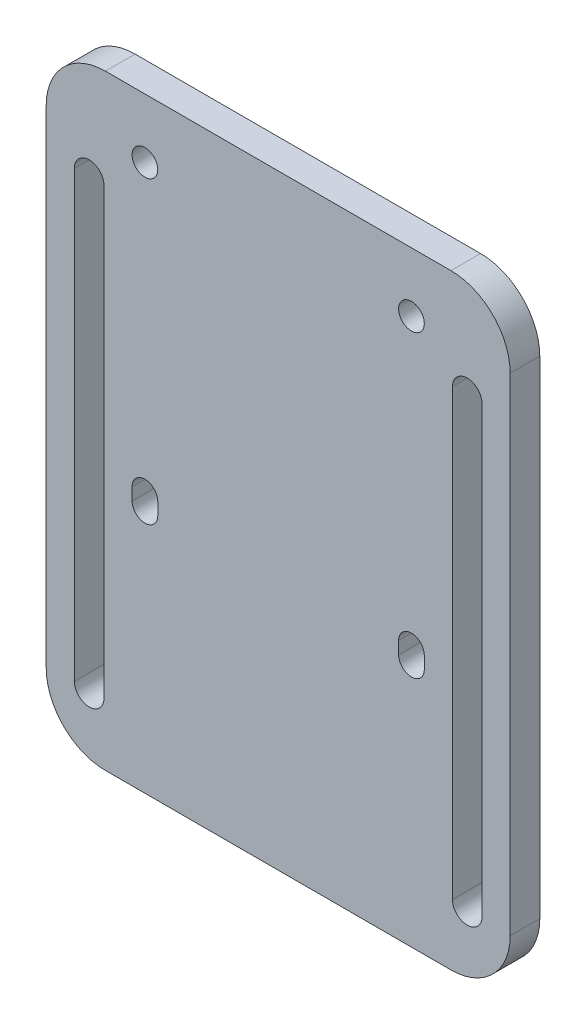
ISO-10303-21;
HEADER;
FILE_DESCRIPTION(('STEP AP214'),'2;1');
FILE_NAME('part.step','',(''),(''),'','','');
FILE_SCHEMA(('AUTOMOTIVE_DESIGN { 1 0 10303 214 1 1 1 1 }'));
ENDSEC;
DATA;
#1=APPLICATION_CONTEXT('core data for automotive mechanical design processes');
#2=APPLICATION_PROTOCOL_DEFINITION('international standard','automotive_design',2000,#1);
#3=PRODUCT_CONTEXT('',#1,'mechanical');
#4=PRODUCT('Part','Part','',(#3));
#5=PRODUCT_RELATED_PRODUCT_CATEGORY('part','',(#4));
#6=PRODUCT_DEFINITION_FORMATION('','',#4);
#7=PRODUCT_DEFINITION_CONTEXT('part definition',#1,'design');
#8=PRODUCT_DEFINITION('design','',#6,#7);
#9=PRODUCT_DEFINITION_SHAPE('','',#8);
#10=(LENGTH_UNIT() NAMED_UNIT(*) SI_UNIT(.MILLI.,.METRE.));
#11=(NAMED_UNIT(*) PLANE_ANGLE_UNIT() SI_UNIT($,.RADIAN.));
#12=(NAMED_UNIT(*) SI_UNIT($,.STERADIAN.) SOLID_ANGLE_UNIT());
#13=UNCERTAINTY_MEASURE_WITH_UNIT(LENGTH_MEASURE(1.E-05),#10,'distance_accuracy_value','');
#14=(GEOMETRIC_REPRESENTATION_CONTEXT(3) GLOBAL_UNCERTAINTY_ASSIGNED_CONTEXT((#13)) GLOBAL_UNIT_ASSIGNED_CONTEXT((#10,
#11,#12)) REPRESENTATION_CONTEXT('',''));
#15=CARTESIAN_POINT('',(0.,0.,0.));
#16=DIRECTION('',(0.,0.,1.));
#17=DIRECTION('',(1.,0.,0.));
#18=AXIS2_PLACEMENT_3D('',#15,#16,#17);
#19=CARTESIAN_POINT('',(-35.3,0.,6.));
#20=DIRECTION('',(1.,0.,0.));
#21=DIRECTION('',(0.,0.,-1.));
#22=AXIS2_PLACEMENT_3D('',#19,#20,#21);
#23=PLANE('',#22);
#24=DIRECTION('',(0.,-1.,0.));
#25=VECTOR('',#24,1.);
#26=CARTESIAN_POINT('',(-35.3,0.,0.));
#27=LINE('',#26,#25);
#28=CARTESIAN_POINT('',(-35.3,102.5,0.));
#29=VERTEX_POINT('',#28);
#30=CARTESIAN_POINT('',(-35.3,12.5,0.));
#31=VERTEX_POINT('',#30);
#32=EDGE_CURVE('E291',#29,#31,#27,.T.);
#33=ORIENTED_EDGE('',*,*,#32,.T.);
#34=DIRECTION('',(0.,0.,-1.));
#35=VECTOR('',#34,1.);
#36=CARTESIAN_POINT('',(-35.3,12.5,6.));
#37=LINE('',#36,#35);
#38=CARTESIAN_POINT('',(-35.3,12.5,6.));
#39=VERTEX_POINT('',#38);
#40=EDGE_CURVE('E11',#39,#31,#37,.T.);
#41=ORIENTED_EDGE('',*,*,#40,.F.);
#42=DIRECTION('',(0.,-1.,0.));
#43=VECTOR('',#42,1.);
#44=CARTESIAN_POINT('',(-35.3,0.,6.));
#45=LINE('',#44,#43);
#46=CARTESIAN_POINT('',(-35.3,102.5,6.));
#47=VERTEX_POINT('',#46);
#48=EDGE_CURVE('E211',#47,#39,#45,.T.);
#49=ORIENTED_EDGE('',*,*,#48,.F.);
#50=DIRECTION('',(0.,0.,-1.));
#51=VECTOR('',#50,1.);
#52=CARTESIAN_POINT('',(-35.3,102.5,6.));
#53=LINE('',#52,#51);
#54=EDGE_CURVE('E55',#47,#29,#53,.T.);
#55=ORIENTED_EDGE('',*,*,#54,.T.);
#56=EDGE_LOOP('',(#33,#41,#49,#55));
#57=FACE_BOUND('',#56,.T.);
#58=ADVANCED_FACE('F36',(#57),#23,.F.);
#59=CARTESIAN_POINT('',(-38.3,12.5,6.));
#60=DIRECTION('',(0.,0.,-1.));
#61=DIRECTION('',(-1.,0.,0.));
#62=AXIS2_PLACEMENT_3D('',#59,#60,#61);
#63=CYLINDRICAL_SURFACE('',#62,3.00000000000002);
#64=CARTESIAN_POINT('',(-38.3,12.5,0.));
#65=DIRECTION('',(0.,0.,1.));
#66=DIRECTION('',(1.,0.,0.));
#67=AXIS2_PLACEMENT_3D('',#64,#65,#66);
#68=CIRCLE('',#67,3.00000000000002);
#69=CARTESIAN_POINT('',(-41.3,12.5,0.));
#70=VERTEX_POINT('',#69);
#71=EDGE_CURVE('E217',#31,#70,#68,.F.);
#72=ORIENTED_EDGE('',*,*,#71,.T.);
#73=DIRECTION('',(0.,0.,-1.));
#74=VECTOR('',#73,1.);
#75=CARTESIAN_POINT('',(-41.3,12.5,6.));
#76=LINE('',#75,#74);
#77=CARTESIAN_POINT('',(-41.3,12.5,6.));
#78=VERTEX_POINT('',#77);
#79=EDGE_CURVE('E46',#78,#70,#76,.T.);
#80=ORIENTED_EDGE('',*,*,#79,.F.);
#81=CARTESIAN_POINT('',(-38.3,12.5,6.));
#82=DIRECTION('',(0.,0.,1.));
#83=DIRECTION('',(1.,0.,0.));
#84=AXIS2_PLACEMENT_3D('',#81,#82,#83);
#85=CIRCLE('',#84,3.00000000000002);
#86=EDGE_CURVE('E205',#39,#78,#85,.F.);
#87=ORIENTED_EDGE('',*,*,#86,.F.);
#88=ORIENTED_EDGE('',*,*,#40,.T.);
#89=EDGE_LOOP('',(#72,#80,#87,#88));
#90=FACE_BOUND('',#89,.T.);
#91=ADVANCED_FACE('F216',(#90),#63,.F.);
#92=CARTESIAN_POINT('',(-41.3,0.,6.));
#93=DIRECTION('',(-1.,0.,0.));
#94=DIRECTION('',(0.,-1.,0.));
#95=AXIS2_PLACEMENT_3D('',#92,#93,#94);
#96=PLANE('',#95);
#97=DIRECTION('',(0.,1.,0.));
#98=VECTOR('',#97,1.);
#99=CARTESIAN_POINT('',(-41.3,0.,0.));
#100=LINE('',#99,#98);
#101=CARTESIAN_POINT('',(-41.3,102.5,0.));
#102=VERTEX_POINT('',#101);
#103=EDGE_CURVE('E294',#70,#102,#100,.T.);
#104=ORIENTED_EDGE('',*,*,#103,.T.);
#105=DIRECTION('',(0.,0.,-1.));
#106=VECTOR('',#105,1.);
#107=CARTESIAN_POINT('',(-41.3,102.5,6.));
#108=LINE('',#107,#106);
#109=CARTESIAN_POINT('',(-41.3,102.5,6.));
#110=VERTEX_POINT('',#109);
#111=EDGE_CURVE('E130',#110,#102,#108,.T.);
#112=ORIENTED_EDGE('',*,*,#111,.F.);
#113=DIRECTION('',(0.,1.,0.));
#114=VECTOR('',#113,1.);
#115=CARTESIAN_POINT('',(-41.3,0.,6.));
#116=LINE('',#115,#114);
#117=EDGE_CURVE('E210',#78,#110,#116,.T.);
#118=ORIENTED_EDGE('',*,*,#117,.F.);
#119=ORIENTED_EDGE('',*,*,#79,.T.);
#120=EDGE_LOOP('',(#104,#112,#118,#119));
#121=FACE_BOUND('',#120,.T.);
#122=ADVANCED_FACE('F221',(#121),#96,.F.);
#123=CARTESIAN_POINT('',(27.,50.,6.));
#124=DIRECTION('',(0.,0.,-1.));
#125=DIRECTION('',(-1.,0.,0.));
#126=AXIS2_PLACEMENT_3D('',#123,#124,#125);
#127=CYLINDRICAL_SURFACE('',#126,2.6000000000001);
#128=CARTESIAN_POINT('',(27.,50.,0.));
#129=DIRECTION('',(0.,0.,1.));
#130=DIRECTION('',(1.,0.,0.));
#131=AXIS2_PLACEMENT_3D('',#128,#129,#130);
#132=CIRCLE('',#131,2.6000000000001);
#133=CARTESIAN_POINT('',(24.3999999999999,50.,0.));
#134=VERTEX_POINT('',#133);
#135=CARTESIAN_POINT('',(29.6000000000001,50.,0.));
#136=VERTEX_POINT('',#135);
#137=EDGE_CURVE('E276',#134,#136,#132,.T.);
#138=ORIENTED_EDGE('',*,*,#137,.F.);
#139=DIRECTION('',(0.,0.,-1.));
#140=VECTOR('',#139,1.);
#141=CARTESIAN_POINT('',(24.3999999999999,50.,6.));
#142=LINE('',#141,#140);
#143=CARTESIAN_POINT('',(24.3999999999999,50.,6.));
#144=VERTEX_POINT('',#143);
#145=EDGE_CURVE('E301',#144,#134,#142,.T.);
#146=ORIENTED_EDGE('',*,*,#145,.F.);
#147=CARTESIAN_POINT('',(27.,50.,6.));
#148=DIRECTION('',(0.,0.,1.));
#149=DIRECTION('',(1.,0.,0.));
#150=AXIS2_PLACEMENT_3D('',#147,#148,#149);
#151=CIRCLE('',#150,2.6000000000001);
#152=CARTESIAN_POINT('',(29.6000000000001,50.,6.));
#153=VERTEX_POINT('',#152);
#154=EDGE_CURVE('E404',#144,#153,#151,.T.);
#155=ORIENTED_EDGE('',*,*,#154,.T.);
#156=DIRECTION('',(0.,0.,-1.));
#157=VECTOR('',#156,1.);
#158=CARTESIAN_POINT('',(29.6000000000001,50.,6.));
#159=LINE('',#158,#157);
#160=EDGE_CURVE('E303',#153,#136,#159,.T.);
#161=ORIENTED_EDGE('',*,*,#160,.T.);
#162=EDGE_LOOP('',(#138,#146,#155,#161));
#163=FACE_BOUND('',#162,.T.);
#164=ADVANCED_FACE('F460',(#163),#127,.F.);
#165=CARTESIAN_POINT('',(24.3999999999999,0.,6.));
#166=DIRECTION('',(-1.,0.,0.));
#167=DIRECTION('',(0.,0.,1.));
#168=AXIS2_PLACEMENT_3D('',#165,#166,#167);
#169=PLANE('',#168);
#170=DIRECTION('',(0.,1.,0.));
#171=VECTOR('',#170,1.);
#172=CARTESIAN_POINT('',(24.3999999999999,0.,0.));
#173=LINE('',#172,#171);
#174=CARTESIAN_POINT('',(24.3999999999999,52.5000000000005,0.));
#175=VERTEX_POINT('',#174);
#176=EDGE_CURVE('E279',#134,#175,#173,.T.);
#177=ORIENTED_EDGE('',*,*,#176,.T.);
#178=DIRECTION('',(0.,0.,-1.));
#179=VECTOR('',#178,1.);
#180=CARTESIAN_POINT('',(24.3999999999999,52.5000000000005,6.));
#181=LINE('',#180,#179);
#182=CARTESIAN_POINT('',(24.3999999999999,52.5000000000005,6.));
#183=VERTEX_POINT('',#182);
#184=EDGE_CURVE('E309',#183,#175,#181,.T.);
#185=ORIENTED_EDGE('',*,*,#184,.F.);
#186=DIRECTION('',(0.,1.,0.));
#187=VECTOR('',#186,1.);
#188=CARTESIAN_POINT('',(24.3999999999999,0.,6.));
#189=LINE('',#188,#187);
#190=EDGE_CURVE('E407',#144,#183,#189,.T.);
#191=ORIENTED_EDGE('',*,*,#190,.F.);
#192=ORIENTED_EDGE('',*,*,#145,.T.);
#193=EDGE_LOOP('',(#177,#185,#191,#192));
#194=FACE_BOUND('',#193,.T.);
#195=ADVANCED_FACE('F456',(#194),#169,.F.);
#196=CARTESIAN_POINT('',(27.,52.5000000000005,6.));
#197=DIRECTION('',(0.,0.,-1.));
#198=DIRECTION('',(-1.,0.,0.));
#199=AXIS2_PLACEMENT_3D('',#196,#197,#198);
#200=CYLINDRICAL_SURFACE('',#199,2.6000000000001);
#201=CARTESIAN_POINT('',(27.,52.5000000000005,0.));
#202=DIRECTION('',(0.,0.,1.));
#203=DIRECTION('',(1.,0.,0.));
#204=AXIS2_PLACEMENT_3D('',#201,#202,#203);
#205=CIRCLE('',#204,2.6000000000001);
#206=CARTESIAN_POINT('',(29.6000000000001,52.5000000000005,0.));
#207=VERTEX_POINT('',#206);
#208=EDGE_CURVE('E282',#175,#207,#205,.F.);
#209=ORIENTED_EDGE('',*,*,#208,.T.);
#210=DIRECTION('',(0.,0.,-1.));
#211=VECTOR('',#210,1.);
#212=CARTESIAN_POINT('',(29.6000000000001,52.5000000000005,6.));
#213=LINE('',#212,#211);
#214=CARTESIAN_POINT('',(29.6000000000001,52.5000000000005,6.));
#215=VERTEX_POINT('',#214);
#216=EDGE_CURVE('E305',#215,#207,#213,.T.);
#217=ORIENTED_EDGE('',*,*,#216,.F.);
#218=CARTESIAN_POINT('',(27.,52.5000000000005,6.));
#219=DIRECTION('',(0.,0.,1.));
#220=DIRECTION('',(1.,0.,0.));
#221=AXIS2_PLACEMENT_3D('',#218,#219,#220);
#222=CIRCLE('',#221,2.6000000000001);
#223=EDGE_CURVE('E410',#183,#215,#222,.F.);
#224=ORIENTED_EDGE('',*,*,#223,.F.);
#225=ORIENTED_EDGE('',*,*,#184,.T.);
#226=EDGE_LOOP('',(#209,#217,#224,#225));
#227=FACE_BOUND('',#226,.T.);
#228=ADVANCED_FACE('F452',(#227),#200,.F.);
#229=CARTESIAN_POINT('',(-35.,110.7,6.));
#230=DIRECTION('',(0.,0.,-1.));
#231=DIRECTION('',(-1.,0.,0.));
#232=AXIS2_PLACEMENT_3D('',#229,#230,#231);
#233=CYLINDRICAL_SURFACE('',#232,12.);
#234=CARTESIAN_POINT('',(-35.,110.7,0.));
#235=DIRECTION('',(0.,0.,1.));
#236=DIRECTION('',(1.,0.,0.));
#237=AXIS2_PLACEMENT_3D('',#234,#235,#236);
#238=CIRCLE('',#237,12.);
#239=CARTESIAN_POINT('',(-47.,110.7,0.));
#240=VERTEX_POINT('',#239);
#241=CARTESIAN_POINT('',(-35.,122.7,0.));
#242=VERTEX_POINT('',#241);
#243=EDGE_CURVE('E249',#240,#242,#238,.F.);
#244=ORIENTED_EDGE('',*,*,#243,.F.);
#245=DIRECTION('',(0.,0.,-1.));
#246=VECTOR('',#245,1.);
#247=CARTESIAN_POINT('',(-47.,110.7,6.));
#248=LINE('',#247,#246);
#249=CARTESIAN_POINT('',(-47.,110.7,6.));
#250=VERTEX_POINT('',#249);
#251=EDGE_CURVE('E306',#250,#240,#248,.T.);
#252=ORIENTED_EDGE('',*,*,#251,.F.);
#253=CARTESIAN_POINT('',(-35.,110.7,6.));
#254=DIRECTION('',(0.,0.,1.));
#255=DIRECTION('',(1.,0.,0.));
#256=AXIS2_PLACEMENT_3D('',#253,#254,#255);
#257=CIRCLE('',#256,12.);
#258=CARTESIAN_POINT('',(-35.,122.7,6.));
#259=VERTEX_POINT('',#258);
#260=EDGE_CURVE('E380',#250,#259,#257,.F.);
#261=ORIENTED_EDGE('',*,*,#260,.T.);
#262=DIRECTION('',(0.,0.,-1.));
#263=VECTOR('',#262,1.);
#264=CARTESIAN_POINT('',(-35.,122.7,6.));
#265=LINE('',#264,#263);
#266=EDGE_CURVE('E313',#259,#242,#265,.T.);
#267=ORIENTED_EDGE('',*,*,#266,.T.);
#268=EDGE_LOOP('',(#244,#252,#261,#267));
#269=FACE_BOUND('',#268,.T.);
#270=ADVANCED_FACE('F455',(#269),#233,.T.);
#271=CARTESIAN_POINT('',(-47.,0.,6.));
#272=DIRECTION('',(-1.,0.,0.));
#273=DIRECTION('',(0.,-1.,0.));
#274=AXIS2_PLACEMENT_3D('',#271,#272,#273);
#275=PLANE('',#274);
#276=DIRECTION('',(0.,1.,0.));
#277=VECTOR('',#276,1.);
#278=CARTESIAN_POINT('',(-47.,0.,0.));
#279=LINE('',#278,#277);
#280=CARTESIAN_POINT('',(-47.,12.,0.));
#281=VERTEX_POINT('',#280);
#282=EDGE_CURVE('E252',#281,#240,#279,.T.);
#283=ORIENTED_EDGE('',*,*,#282,.F.);
#284=DIRECTION('',(0.,0.,-1.));
#285=VECTOR('',#284,1.);
#286=CARTESIAN_POINT('',(-47.,12.,6.));
#287=LINE('',#286,#285);
#288=CARTESIAN_POINT('',(-47.,12.,6.));
#289=VERTEX_POINT('',#288);
#290=EDGE_CURVE('E326',#289,#281,#287,.T.);
#291=ORIENTED_EDGE('',*,*,#290,.F.);
#292=DIRECTION('',(0.,1.,0.));
#293=VECTOR('',#292,1.);
#294=CARTESIAN_POINT('',(-47.,0.,6.));
#295=LINE('',#294,#293);
#296=EDGE_CURVE('E383',#289,#250,#295,.T.);
#297=ORIENTED_EDGE('',*,*,#296,.T.);
#298=ORIENTED_EDGE('',*,*,#251,.T.);
#299=EDGE_LOOP('',(#283,#291,#297,#298));
#300=FACE_BOUND('',#299,.T.);
#301=ADVANCED_FACE('F492',(#300),#275,.T.);
#302=CARTESIAN_POINT('',(-35.,12.,6.));
#303=DIRECTION('',(0.,0.,-1.));
#304=DIRECTION('',(-1.,0.,0.));
#305=AXIS2_PLACEMENT_3D('',#302,#303,#304);
#306=CYLINDRICAL_SURFACE('',#305,12.);
#307=CARTESIAN_POINT('',(-35.,12.,0.));
#308=DIRECTION('',(0.,0.,1.));
#309=DIRECTION('',(1.,0.,0.));
#310=AXIS2_PLACEMENT_3D('',#307,#308,#309);
#311=CIRCLE('',#310,12.);
#312=CARTESIAN_POINT('',(-35.,0.,0.));
#313=VERTEX_POINT('',#312);
#314=EDGE_CURVE('E255',#281,#313,#311,.T.);
#315=ORIENTED_EDGE('',*,*,#314,.T.);
#316=DIRECTION('',(0.,0.,-1.));
#317=VECTOR('',#316,1.);
#318=CARTESIAN_POINT('',(-35.,0.,6.));
#319=LINE('',#318,#317);
#320=CARTESIAN_POINT('',(-35.,0.,6.));
#321=VERTEX_POINT('',#320);
#322=EDGE_CURVE('E324',#321,#313,#319,.T.);
#323=ORIENTED_EDGE('',*,*,#322,.F.);
#324=CARTESIAN_POINT('',(-35.,12.,6.));
#325=DIRECTION('',(0.,0.,1.));
#326=DIRECTION('',(1.,0.,0.));
#327=AXIS2_PLACEMENT_3D('',#324,#325,#326);
#328=CIRCLE('',#327,12.);
#329=EDGE_CURVE('E386',#289,#321,#328,.T.);
#330=ORIENTED_EDGE('',*,*,#329,.F.);
#331=ORIENTED_EDGE('',*,*,#290,.T.);
#332=EDGE_LOOP('',(#315,#323,#330,#331));
#333=FACE_BOUND('',#332,.T.);
#334=ADVANCED_FACE('F488',(#333),#306,.T.);
#335=CARTESIAN_POINT('',(0.,0.,6.));
#336=DIRECTION('',(0.,-1.,0.));
#337=DIRECTION('',(1.,0.,0.));
#338=AXIS2_PLACEMENT_3D('',#335,#336,#337);
#339=PLANE('',#338);
#340=DIRECTION('',(-1.,0.,0.));
#341=VECTOR('',#340,1.);
#342=CARTESIAN_POINT('',(0.,0.,0.));
#343=LINE('',#342,#341);
#344=CARTESIAN_POINT('',(35.,0.,0.));
#345=VERTEX_POINT('',#344);
#346=EDGE_CURVE('E258',#345,#313,#343,.T.);
#347=ORIENTED_EDGE('',*,*,#346,.F.);
#348=DIRECTION('',(0.,0.,-1.));
#349=VECTOR('',#348,1.);
#350=CARTESIAN_POINT('',(35.,0.,6.));
#351=LINE('',#350,#349);
#352=CARTESIAN_POINT('',(35.,0.,6.));
#353=VERTEX_POINT('',#352);
#354=EDGE_CURVE('E322',#353,#345,#351,.T.);
#355=ORIENTED_EDGE('',*,*,#354,.F.);
#356=DIRECTION('',(-1.,0.,0.));
#357=VECTOR('',#356,1.);
#358=CARTESIAN_POINT('',(0.,0.,6.));
#359=LINE('',#358,#357);
#360=EDGE_CURVE('E388',#353,#321,#359,.T.);
#361=ORIENTED_EDGE('',*,*,#360,.T.);
#362=ORIENTED_EDGE('',*,*,#322,.T.);
#363=EDGE_LOOP('',(#347,#355,#361,#362));
#364=FACE_BOUND('',#363,.T.);
#365=ADVANCED_FACE('F484',(#364),#339,.T.);
#366=CARTESIAN_POINT('',(35.,12.,6.));
#367=DIRECTION('',(0.,0.,-1.));
#368=DIRECTION('',(-1.,0.,0.));
#369=AXIS2_PLACEMENT_3D('',#366,#367,#368);
#370=CYLINDRICAL_SURFACE('',#369,12.);
#371=CARTESIAN_POINT('',(35.,12.,0.));
#372=DIRECTION('',(0.,0.,1.));
#373=DIRECTION('',(1.,0.,0.));
#374=AXIS2_PLACEMENT_3D('',#371,#372,#373);
#375=CIRCLE('',#374,12.);
#376=CARTESIAN_POINT('',(47.,12.,0.));
#377=VERTEX_POINT('',#376);
#378=EDGE_CURVE('E261',#345,#377,#375,.T.);
#379=ORIENTED_EDGE('',*,*,#378,.T.);
#380=DIRECTION('',(0.,0.,-1.));
#381=VECTOR('',#380,1.);
#382=CARTESIAN_POINT('',(47.,12.,6.));
#383=LINE('',#382,#381);
#384=CARTESIAN_POINT('',(47.,12.,6.));
#385=VERTEX_POINT('',#384);
#386=EDGE_CURVE('E320',#385,#377,#383,.T.);
#387=ORIENTED_EDGE('',*,*,#386,.F.);
#388=CARTESIAN_POINT('',(35.,12.,6.));
#389=DIRECTION('',(0.,0.,1.));
#390=DIRECTION('',(1.,0.,0.));
#391=AXIS2_PLACEMENT_3D('',#388,#389,#390);
#392=CIRCLE('',#391,12.);
#393=EDGE_CURVE('E391',#353,#385,#392,.T.);
#394=ORIENTED_EDGE('',*,*,#393,.F.);
#395=ORIENTED_EDGE('',*,*,#354,.T.);
#396=EDGE_LOOP('',(#379,#387,#394,#395));
#397=FACE_BOUND('',#396,.T.);
#398=ADVANCED_FACE('F480',(#397),#370,.T.);
#399=CARTESIAN_POINT('',(47.,0.,6.));
#400=DIRECTION('',(1.,0.,0.));
#401=DIRECTION('',(0.,1.,0.));
#402=AXIS2_PLACEMENT_3D('',#399,#400,#401);
#403=PLANE('',#402);
#404=DIRECTION('',(0.,-1.,0.));
#405=VECTOR('',#404,1.);
#406=CARTESIAN_POINT('',(47.,0.,0.));
#407=LINE('',#406,#405);
#408=CARTESIAN_POINT('',(47.,110.7,0.));
#409=VERTEX_POINT('',#408);
#410=EDGE_CURVE('E264',#409,#377,#407,.T.);
#411=ORIENTED_EDGE('',*,*,#410,.F.);
#412=DIRECTION('',(0.,0.,-1.));
#413=VECTOR('',#412,1.);
#414=CARTESIAN_POINT('',(47.,110.7,6.));
#415=LINE('',#414,#413);
#416=CARTESIAN_POINT('',(47.,110.7,6.));
#417=VERTEX_POINT('',#416);
#418=EDGE_CURVE('E318',#417,#409,#415,.T.);
#419=ORIENTED_EDGE('',*,*,#418,.F.);
#420=DIRECTION('',(0.,-1.,0.));
#421=VECTOR('',#420,1.);
#422=CARTESIAN_POINT('',(47.,0.,6.));
#423=LINE('',#422,#421);
#424=EDGE_CURVE('E393',#417,#385,#423,.T.);
#425=ORIENTED_EDGE('',*,*,#424,.T.);
#426=ORIENTED_EDGE('',*,*,#386,.T.);
#427=EDGE_LOOP('',(#411,#419,#425,#426));
#428=FACE_BOUND('',#427,.T.);
#429=ADVANCED_FACE('F476',(#428),#403,.T.);
#430=CARTESIAN_POINT('',(35.,110.7,6.));
#431=DIRECTION('',(0.,0.,-1.));
#432=DIRECTION('',(-1.,0.,0.));
#433=AXIS2_PLACEMENT_3D('',#430,#431,#432);
#434=CYLINDRICAL_SURFACE('',#433,12.);
#435=CARTESIAN_POINT('',(35.,110.7,0.));
#436=DIRECTION('',(0.,0.,1.));
#437=DIRECTION('',(1.,0.,0.));
#438=AXIS2_PLACEMENT_3D('',#435,#436,#437);
#439=CIRCLE('',#438,12.);
#440=CARTESIAN_POINT('',(35.,122.7,0.));
#441=VERTEX_POINT('',#440);
#442=EDGE_CURVE('E267',#409,#441,#439,.T.);
#443=ORIENTED_EDGE('',*,*,#442,.T.);
#444=DIRECTION('',(0.,0.,-1.));
#445=VECTOR('',#444,1.);
#446=CARTESIAN_POINT('',(35.,122.7,6.));
#447=LINE('',#446,#445);
#448=CARTESIAN_POINT('',(35.,122.7,6.));
#449=VERTEX_POINT('',#448);
#450=EDGE_CURVE('E315',#449,#441,#447,.T.);
#451=ORIENTED_EDGE('',*,*,#450,.F.);
#452=CARTESIAN_POINT('',(35.,110.7,6.));
#453=DIRECTION('',(0.,0.,1.));
#454=DIRECTION('',(1.,0.,0.));
#455=AXIS2_PLACEMENT_3D('',#452,#453,#454);
#456=CIRCLE('',#455,12.);
#457=EDGE_CURVE('E396',#417,#449,#456,.T.);
#458=ORIENTED_EDGE('',*,*,#457,.F.);
#459=ORIENTED_EDGE('',*,*,#418,.T.);
#460=EDGE_LOOP('',(#443,#451,#458,#459));
#461=FACE_BOUND('',#460,.T.);
#462=ADVANCED_FACE('F472',(#461),#434,.T.);
#463=CARTESIAN_POINT('',(35.3,0.,6.));
#464=DIRECTION('',(-1.,0.,0.));
#465=DIRECTION('',(0.,-1.,0.));
#466=AXIS2_PLACEMENT_3D('',#463,#464,#465);
#467=PLANE('',#466);
#468=DIRECTION('',(0.,1.,0.));
#469=VECTOR('',#468,1.);
#470=CARTESIAN_POINT('',(35.3,0.,0.));
#471=LINE('',#470,#469);
#472=CARTESIAN_POINT('',(35.3,12.5,0.));
#473=VERTEX_POINT('',#472);
#474=CARTESIAN_POINT('',(35.3,102.5,0.));
#475=VERTEX_POINT('',#474);
#476=EDGE_CURVE('E238',#473,#475,#471,.T.);
#477=ORIENTED_EDGE('',*,*,#476,.T.);
#478=DIRECTION('',(0.,0.,-1.));
#479=VECTOR('',#478,1.);
#480=CARTESIAN_POINT('',(35.3,102.5,6.));
#481=LINE('',#480,#479);
#482=CARTESIAN_POINT('',(35.3,102.5,6.));
#483=VERTEX_POINT('',#482);
#484=EDGE_CURVE('E316',#483,#475,#481,.T.);
#485=ORIENTED_EDGE('',*,*,#484,.F.);
#486=DIRECTION('',(0.,1.,0.));
#487=VECTOR('',#486,1.);
#488=CARTESIAN_POINT('',(35.3,0.,6.));
#489=LINE('',#488,#487);
#490=CARTESIAN_POINT('',(35.3,12.5,6.));
#491=VERTEX_POINT('',#490);
#492=EDGE_CURVE('E366',#491,#483,#489,.T.);
#493=ORIENTED_EDGE('',*,*,#492,.F.);
#494=DIRECTION('',(0.,0.,-1.));
#495=VECTOR('',#494,1.);
#496=CARTESIAN_POINT('',(35.3,12.5,6.));
#497=LINE('',#496,#495);
#498=EDGE_CURVE('E329',#491,#473,#497,.T.);
#499=ORIENTED_EDGE('',*,*,#498,.T.);
#500=EDGE_LOOP('',(#477,#485,#493,#499));
#501=FACE_BOUND('',#500,.T.);
#502=ADVANCED_FACE('F475',(#501),#467,.F.);
#503=CARTESIAN_POINT('',(38.3,102.5,6.));
#504=DIRECTION('',(0.,0.,-1.));
#505=DIRECTION('',(-1.,0.,0.));
#506=AXIS2_PLACEMENT_3D('',#503,#504,#505);
#507=CYLINDRICAL_SURFACE('',#506,3.00000000000003);
#508=CARTESIAN_POINT('',(38.3,102.5,0.));
#509=DIRECTION('',(0.,0.,1.));
#510=DIRECTION('',(1.,0.,0.));
#511=AXIS2_PLACEMENT_3D('',#508,#509,#510);
#512=CIRCLE('',#511,3.00000000000003);
#513=CARTESIAN_POINT('',(41.3,102.5,0.));
#514=VERTEX_POINT('',#513);
#515=EDGE_CURVE('E241',#475,#514,#512,.F.);
#516=ORIENTED_EDGE('',*,*,#515,.T.);
#517=DIRECTION('',(0.,0.,-1.));
#518=VECTOR('',#517,1.);
#519=CARTESIAN_POINT('',(41.3,102.5,6.));
#520=LINE('',#519,#518);
#521=CARTESIAN_POINT('',(41.3,102.5,6.));
#522=VERTEX_POINT('',#521);
#523=EDGE_CURVE('E333',#522,#514,#520,.T.);
#524=ORIENTED_EDGE('',*,*,#523,.F.);
#525=CARTESIAN_POINT('',(38.3,102.5,6.));
#526=DIRECTION('',(0.,0.,1.));
#527=DIRECTION('',(1.,0.,0.));
#528=AXIS2_PLACEMENT_3D('',#525,#526,#527);
#529=CIRCLE('',#528,3.00000000000003);
#530=EDGE_CURVE('E373',#483,#522,#529,.F.);
#531=ORIENTED_EDGE('',*,*,#530,.F.);
#532=ORIENTED_EDGE('',*,*,#484,.T.);
#533=EDGE_LOOP('',(#516,#524,#531,#532));
#534=FACE_BOUND('',#533,.T.);
#535=ADVANCED_FACE('F506',(#534),#507,.F.);
#536=CARTESIAN_POINT('',(41.3,0.,6.));
#537=DIRECTION('',(1.,0.,0.));
#538=DIRECTION('',(0.,1.,0.));
#539=AXIS2_PLACEMENT_3D('',#536,#537,#538);
#540=PLANE('',#539);
#541=DIRECTION('',(0.,-1.,0.));
#542=VECTOR('',#541,1.);
#543=CARTESIAN_POINT('',(41.3,0.,0.));
#544=LINE('',#543,#542);
#545=CARTESIAN_POINT('',(41.3,12.5,0.));
#546=VERTEX_POINT('',#545);
#547=EDGE_CURVE('E243',#514,#546,#544,.T.);
#548=ORIENTED_EDGE('',*,*,#547,.T.);
#549=DIRECTION('',(0.,0.,-1.));
#550=VECTOR('',#549,1.);
#551=CARTESIAN_POINT('',(41.3,12.5,6.));
#552=LINE('',#551,#550);
#553=CARTESIAN_POINT('',(41.3,12.5,6.));
#554=VERTEX_POINT('',#553);
#555=EDGE_CURVE('E331',#554,#546,#552,.T.);
#556=ORIENTED_EDGE('',*,*,#555,.F.);
#557=DIRECTION('',(0.,-1.,0.));
#558=VECTOR('',#557,1.);
#559=CARTESIAN_POINT('',(41.3,0.,6.));
#560=LINE('',#559,#558);
#561=EDGE_CURVE('E375',#522,#554,#560,.T.);
#562=ORIENTED_EDGE('',*,*,#561,.F.);
#563=ORIENTED_EDGE('',*,*,#523,.T.);
#564=EDGE_LOOP('',(#548,#556,#562,#563));
#565=FACE_BOUND('',#564,.T.);
#566=ADVANCED_FACE('F503',(#565),#540,.F.);
#567=CARTESIAN_POINT('',(-27.0000000000001,52.5000000000005,6.));
#568=DIRECTION('',(0.,0.,-1.));
#569=DIRECTION('',(-1.,0.,0.));
#570=AXIS2_PLACEMENT_3D('',#567,#568,#569);
#571=CYLINDRICAL_SURFACE('',#570,2.6000000000001);
#572=CARTESIAN_POINT('',(-27.0000000000001,52.5000000000005,0.));
#573=DIRECTION('',(0.,0.,1.));
#574=DIRECTION('',(1.,0.,0.));
#575=AXIS2_PLACEMENT_3D('',#572,#573,#574);
#576=CIRCLE('',#575,2.6000000000001);
#577=CARTESIAN_POINT('',(-24.4,52.5000000000005,0.));
#578=VERTEX_POINT('',#577);
#579=CARTESIAN_POINT('',(-29.6000000000002,52.5000000000005,0.));
#580=VERTEX_POINT('',#579);
#581=EDGE_CURVE('E228',#578,#580,#576,.T.);
#582=ORIENTED_EDGE('',*,*,#581,.F.);
#583=DIRECTION('',(0.,0.,-1.));
#584=VECTOR('',#583,1.);
#585=CARTESIAN_POINT('',(-24.4,52.5000000000005,6.));
#586=LINE('',#585,#584);
#587=CARTESIAN_POINT('',(-24.4,52.5000000000005,6.));
#588=VERTEX_POINT('',#587);
#589=EDGE_CURVE('E40',#588,#578,#586,.T.);
#590=ORIENTED_EDGE('',*,*,#589,.F.);
#591=CARTESIAN_POINT('',(-27.0000000000001,52.5000000000005,6.));
#592=DIRECTION('',(0.,0.,1.));
#593=DIRECTION('',(1.,0.,0.));
#594=AXIS2_PLACEMENT_3D('',#591,#592,#593);
#595=CIRCLE('',#594,2.6000000000001);
#596=CARTESIAN_POINT('',(-29.6000000000002,52.5000000000005,6.));
#597=VERTEX_POINT('',#596);
#598=EDGE_CURVE('E299',#588,#597,#595,.T.);
#599=ORIENTED_EDGE('',*,*,#598,.T.);
#600=DIRECTION('',(0.,0.,-1.));
#601=VECTOR('',#600,1.);
#602=CARTESIAN_POINT('',(-29.6000000000002,52.5000000000005,6.));
#603=LINE('',#602,#601);
#604=EDGE_CURVE('E224',#597,#580,#603,.T.);
#605=ORIENTED_EDGE('',*,*,#604,.T.);
#606=EDGE_LOOP('',(#582,#590,#599,#605));
#607=FACE_BOUND('',#606,.T.);
#608=ADVANCED_FACE('F38',(#607),#571,.F.);
#609=CARTESIAN_POINT('',(-24.4,0.,6.));
#610=DIRECTION('',(1.,0.,0.));
#611=DIRECTION('',(0.,0.,-1.));
#612=AXIS2_PLACEMENT_3D('',#609,#610,#611);
#613=PLANE('',#612);
#614=DIRECTION('',(0.,-1.,0.));
#615=VECTOR('',#614,1.);
#616=CARTESIAN_POINT('',(-24.4,0.,0.));
#617=LINE('',#616,#615);
#618=CARTESIAN_POINT('',(-24.4,50.,0.));
#619=VERTEX_POINT('',#618);
#620=EDGE_CURVE('E231',#578,#619,#617,.T.);
#621=ORIENTED_EDGE('',*,*,#620,.T.);
#622=DIRECTION('',(0.,0.,-1.));
#623=VECTOR('',#622,1.);
#624=CARTESIAN_POINT('',(-24.4,50.,6.));
#625=LINE('',#624,#623);
#626=CARTESIAN_POINT('',(-24.4,50.,6.));
#627=VERTEX_POINT('',#626);
#628=EDGE_CURVE('E341',#627,#619,#625,.T.);
#629=ORIENTED_EDGE('',*,*,#628,.F.);
#630=DIRECTION('',(0.,-1.,0.));
#631=VECTOR('',#630,1.);
#632=CARTESIAN_POINT('',(-24.4,0.,6.));
#633=LINE('',#632,#631);
#634=EDGE_CURVE('E350',#588,#627,#633,.T.);
#635=ORIENTED_EDGE('',*,*,#634,.F.);
#636=ORIENTED_EDGE('',*,*,#589,.T.);
#637=EDGE_LOOP('',(#621,#629,#635,#636));
#638=FACE_BOUND('',#637,.T.);
#639=ADVANCED_FACE('F349',(#638),#613,.F.);
#640=CARTESIAN_POINT('',(-27.0000000000001,50.,6.));
#641=DIRECTION('',(0.,0.,-1.));
#642=DIRECTION('',(-1.,0.,0.));
#643=AXIS2_PLACEMENT_3D('',#640,#641,#642);
#644=CYLINDRICAL_SURFACE('',#643,2.6000000000001);
#645=CARTESIAN_POINT('',(-27.0000000000001,50.,0.));
#646=DIRECTION('',(0.,0.,1.));
#647=DIRECTION('',(1.,0.,0.));
#648=AXIS2_PLACEMENT_3D('',#645,#646,#647);
#649=CIRCLE('',#648,2.6000000000001);
#650=CARTESIAN_POINT('',(-29.6000000000002,50.,0.));
#651=VERTEX_POINT('',#650);
#652=EDGE_CURVE('E233',#619,#651,#649,.F.);
#653=ORIENTED_EDGE('',*,*,#652,.T.);
#654=DIRECTION('',(0.,0.,-1.));
#655=VECTOR('',#654,1.);
#656=CARTESIAN_POINT('',(-29.6000000000002,50.,6.));
#657=LINE('',#656,#655);
#658=CARTESIAN_POINT('',(-29.6000000000002,50.,6.));
#659=VERTEX_POINT('',#658);
#660=EDGE_CURVE('E339',#659,#651,#657,.T.);
#661=ORIENTED_EDGE('',*,*,#660,.F.);
#662=CARTESIAN_POINT('',(-27.0000000000001,50.,6.));
#663=DIRECTION('',(0.,0.,1.));
#664=DIRECTION('',(1.,0.,0.));
#665=AXIS2_PLACEMENT_3D('',#662,#663,#664);
#666=CIRCLE('',#665,2.6000000000001);
#667=EDGE_CURVE('E363',#627,#659,#666,.F.);
#668=ORIENTED_EDGE('',*,*,#667,.F.);
#669=ORIENTED_EDGE('',*,*,#628,.T.);
#670=EDGE_LOOP('',(#653,#661,#668,#669));
#671=FACE_BOUND('',#670,.T.);
#672=ADVANCED_FACE('F362',(#671),#644,.F.);
#673=CARTESIAN_POINT('',(-27.,110.7,6.));
#674=DIRECTION('',(0.,0.,-1.));
#675=DIRECTION('',(-1.,0.,0.));
#676=AXIS2_PLACEMENT_3D('',#673,#674,#675);
#677=CYLINDRICAL_SURFACE('',#676,2.6);
#678=CARTESIAN_POINT('',(-27.,110.7,6.));
#679=DIRECTION('',(0.,0.,1.));
#680=DIRECTION('',(1.,0.,0.));
#681=AXIS2_PLACEMENT_3D('',#678,#679,#680);
#682=CIRCLE('',#681,2.6);
#683=CARTESIAN_POINT('',(-24.4,110.7,6.));
#684=VERTEX_POINT('',#683);
#685=EDGE_CURVE('E415',#684,#684,#682,.F.);
#686=ORIENTED_EDGE('',*,*,#685,.F.);
#687=EDGE_LOOP('',(#686));
#688=FACE_BOUND('',#687,.T.);
#689=CARTESIAN_POINT('',(-27.,110.7,0.));
#690=DIRECTION('',(0.,0.,1.));
#691=DIRECTION('',(1.,0.,0.));
#692=AXIS2_PLACEMENT_3D('',#689,#690,#691);
#693=CIRCLE('',#692,2.6);
#694=CARTESIAN_POINT('',(-24.4,110.7,0.));
#695=VERTEX_POINT('',#694);
#696=EDGE_CURVE('E288',#695,#695,#693,.F.);
#697=ORIENTED_EDGE('',*,*,#696,.T.);
#698=EDGE_LOOP('',(#697));
#699=FACE_BOUND('',#698,.T.);
#700=ADVANCED_FACE('F420',(#688,#699),#677,.F.);
#701=CARTESIAN_POINT('',(29.6000000000002,0.,6.));
#702=DIRECTION('',(1.,0.,0.));
#703=DIRECTION('',(0.,1.,0.));
#704=AXIS2_PLACEMENT_3D('',#701,#702,#703);
#705=PLANE('',#704);
#706=DIRECTION('',(0.,-1.,0.));
#707=VECTOR('',#706,1.);
#708=CARTESIAN_POINT('',(29.6000000000002,0.,0.));
#709=LINE('',#708,#707);
#710=EDGE_CURVE('E285',#207,#136,#709,.T.);
#711=ORIENTED_EDGE('',*,*,#710,.T.);
#712=ORIENTED_EDGE('',*,*,#160,.F.);
#713=DIRECTION('',(0.,-1.,0.));
#714=VECTOR('',#713,1.);
#715=CARTESIAN_POINT('',(29.6000000000002,0.,6.));
#716=LINE('',#715,#714);
#717=EDGE_CURVE('E413',#215,#153,#716,.T.);
#718=ORIENTED_EDGE('',*,*,#717,.F.);
#719=ORIENTED_EDGE('',*,*,#216,.T.);
#720=EDGE_LOOP('',(#711,#712,#718,#719));
#721=FACE_BOUND('',#720,.T.);
#722=ADVANCED_FACE('F423',(#721),#705,.F.);
#723=CARTESIAN_POINT('',(27.,110.7,6.));
#724=DIRECTION('',(0.,0.,-1.));
#725=DIRECTION('',(-1.,0.,0.));
#726=AXIS2_PLACEMENT_3D('',#723,#724,#725);
#727=CYLINDRICAL_SURFACE('',#726,2.6);
#728=CARTESIAN_POINT('',(27.,110.7,6.));
#729=DIRECTION('',(0.,0.,1.));
#730=DIRECTION('',(1.,0.,0.));
#731=AXIS2_PLACEMENT_3D('',#728,#729,#730);
#732=CIRCLE('',#731,2.6);
#733=CARTESIAN_POINT('',(29.6,110.7,6.));
#734=VERTEX_POINT('',#733);
#735=EDGE_CURVE('E401',#734,#734,#732,.T.);
#736=ORIENTED_EDGE('',*,*,#735,.T.);
#737=EDGE_LOOP('',(#736));
#738=FACE_BOUND('',#737,.T.);
#739=CARTESIAN_POINT('',(27.,110.7,0.));
#740=DIRECTION('',(0.,0.,1.));
#741=DIRECTION('',(1.,0.,0.));
#742=AXIS2_PLACEMENT_3D('',#739,#740,#741);
#743=CIRCLE('',#742,2.6);
#744=CARTESIAN_POINT('',(29.6,110.7,0.));
#745=VERTEX_POINT('',#744);
#746=EDGE_CURVE('E273',#745,#745,#743,.T.);
#747=ORIENTED_EDGE('',*,*,#746,.F.);
#748=EDGE_LOOP('',(#747));
#749=FACE_BOUND('',#748,.T.);
#750=ADVANCED_FACE('F450',(#738,#749),#727,.F.);
#751=CARTESIAN_POINT('',(0.,122.7,6.));
#752=DIRECTION('',(0.,1.,0.));
#753=DIRECTION('',(-1.,0.,0.));
#754=AXIS2_PLACEMENT_3D('',#751,#752,#753);
#755=PLANE('',#754);
#756=DIRECTION('',(1.,0.,0.));
#757=VECTOR('',#756,1.);
#758=CARTESIAN_POINT('',(0.,122.7,0.));
#759=LINE('',#758,#757);
#760=EDGE_CURVE('E270',#242,#441,#759,.T.);
#761=ORIENTED_EDGE('',*,*,#760,.F.);
#762=ORIENTED_EDGE('',*,*,#266,.F.);
#763=DIRECTION('',(1.,0.,0.));
#764=VECTOR('',#763,1.);
#765=CARTESIAN_POINT('',(0.,122.7,6.));
#766=LINE('',#765,#764);
#767=EDGE_CURVE('E398',#259,#449,#766,.T.);
#768=ORIENTED_EDGE('',*,*,#767,.T.);
#769=ORIENTED_EDGE('',*,*,#450,.T.);
#770=EDGE_LOOP('',(#761,#762,#768,#769));
#771=FACE_BOUND('',#770,.T.);
#772=ADVANCED_FACE('F467',(#771),#755,.T.);
#773=CARTESIAN_POINT('',(38.3,12.5,6.));
#774=DIRECTION('',(0.,0.,-1.));
#775=DIRECTION('',(-1.,0.,0.));
#776=AXIS2_PLACEMENT_3D('',#773,#774,#775);
#777=CYLINDRICAL_SURFACE('',#776,3.00000000000002);
#778=CARTESIAN_POINT('',(38.3,12.5,0.));
#779=DIRECTION('',(0.,0.,1.));
#780=DIRECTION('',(1.,0.,0.));
#781=AXIS2_PLACEMENT_3D('',#778,#779,#780);
#782=CIRCLE('',#781,3.00000000000002);
#783=EDGE_CURVE('E246',#473,#546,#782,.T.);
#784=ORIENTED_EDGE('',*,*,#783,.F.);
#785=ORIENTED_EDGE('',*,*,#498,.F.);
#786=CARTESIAN_POINT('',(38.3,12.5,6.));
#787=DIRECTION('',(0.,0.,1.));
#788=DIRECTION('',(1.,0.,0.));
#789=AXIS2_PLACEMENT_3D('',#786,#787,#788);
#790=CIRCLE('',#789,3.00000000000002);
#791=EDGE_CURVE('E377',#491,#554,#790,.T.);
#792=ORIENTED_EDGE('',*,*,#791,.T.);
#793=ORIENTED_EDGE('',*,*,#555,.T.);
#794=EDGE_LOOP('',(#784,#785,#792,#793));
#795=FACE_BOUND('',#794,.T.);
#796=ADVANCED_FACE('F438',(#795),#777,.F.);
#797=CARTESIAN_POINT('',(-29.6000000000003,0.,6.));
#798=DIRECTION('',(-1.,0.,0.));
#799=DIRECTION('',(0.,-1.,0.));
#800=AXIS2_PLACEMENT_3D('',#797,#798,#799);
#801=PLANE('',#800);
#802=DIRECTION('',(0.,1.,0.));
#803=VECTOR('',#802,1.);
#804=CARTESIAN_POINT('',(-29.6000000000003,0.,0.));
#805=LINE('',#804,#803);
#806=EDGE_CURVE('E235',#651,#580,#805,.T.);
#807=ORIENTED_EDGE('',*,*,#806,.T.);
#808=ORIENTED_EDGE('',*,*,#604,.F.);
#809=DIRECTION('',(0.,1.,0.));
#810=VECTOR('',#809,1.);
#811=CARTESIAN_POINT('',(-29.6000000000003,0.,6.));
#812=LINE('',#811,#810);
#813=EDGE_CURVE('E361',#659,#597,#812,.T.);
#814=ORIENTED_EDGE('',*,*,#813,.F.);
#815=ORIENTED_EDGE('',*,*,#660,.T.);
#816=EDGE_LOOP('',(#807,#808,#814,#815));
#817=FACE_BOUND('',#816,.T.);
#818=ADVANCED_FACE('F359',(#817),#801,.F.);
#819=CARTESIAN_POINT('',(-38.3,102.5,6.));
#820=DIRECTION('',(0.,0.,-1.));
#821=DIRECTION('',(-1.,0.,0.));
#822=AXIS2_PLACEMENT_3D('',#819,#820,#821);
#823=CYLINDRICAL_SURFACE('',#822,3.00000000000003);
#824=CARTESIAN_POINT('',(-38.3,102.5,0.));
#825=DIRECTION('',(0.,0.,1.));
#826=DIRECTION('',(1.,0.,0.));
#827=AXIS2_PLACEMENT_3D('',#824,#825,#826);
#828=CIRCLE('',#827,3.00000000000003);
#829=EDGE_CURVE('E296',#29,#102,#828,.T.);
#830=ORIENTED_EDGE('',*,*,#829,.F.);
#831=ORIENTED_EDGE('',*,*,#54,.F.);
#832=CARTESIAN_POINT('',(-38.3,102.5,6.));
#833=DIRECTION('',(0.,0.,1.));
#834=DIRECTION('',(1.,0.,0.));
#835=AXIS2_PLACEMENT_3D('',#832,#833,#834);
#836=CIRCLE('',#835,3.00000000000003);
#837=EDGE_CURVE('E222',#47,#110,#836,.T.);
#838=ORIENTED_EDGE('',*,*,#837,.T.);
#839=ORIENTED_EDGE('',*,*,#111,.T.);
#840=EDGE_LOOP('',(#830,#831,#838,#839));
#841=FACE_BOUND('',#840,.T.);
#842=ADVANCED_FACE('F430',(#841),#823,.F.);
#843=CARTESIAN_POINT('',(0.,0.,6.));
#844=DIRECTION('',(0.,0.,1.));
#845=DIRECTION('',(1.,0.,0.));
#846=AXIS2_PLACEMENT_3D('',#843,#844,#845);
#847=PLANE('',#846);
#848=ORIENTED_EDGE('',*,*,#598,.F.);
#849=ORIENTED_EDGE('',*,*,#634,.T.);
#850=ORIENTED_EDGE('',*,*,#667,.T.);
#851=ORIENTED_EDGE('',*,*,#813,.T.);
#852=EDGE_LOOP('',(#848,#849,#850,#851));
#853=FACE_BOUND('',#852,.T.);
#854=ORIENTED_EDGE('',*,*,#492,.T.);
#855=ORIENTED_EDGE('',*,*,#530,.T.);
#856=ORIENTED_EDGE('',*,*,#561,.T.);
#857=ORIENTED_EDGE('',*,*,#791,.F.);
#858=EDGE_LOOP('',(#854,#855,#856,#857));
#859=FACE_BOUND('',#858,.T.);
#860=ORIENTED_EDGE('',*,*,#260,.F.);
#861=ORIENTED_EDGE('',*,*,#296,.F.);
#862=ORIENTED_EDGE('',*,*,#329,.T.);
#863=ORIENTED_EDGE('',*,*,#360,.F.);
#864=ORIENTED_EDGE('',*,*,#393,.T.);
#865=ORIENTED_EDGE('',*,*,#424,.F.);
#866=ORIENTED_EDGE('',*,*,#457,.T.);
#867=ORIENTED_EDGE('',*,*,#767,.F.);
#868=EDGE_LOOP('',(#860,#861,#862,#863,#864,#865,#866,#867));
#869=FACE_BOUND('',#868,.T.);
#870=ORIENTED_EDGE('',*,*,#735,.F.);
#871=EDGE_LOOP('',(#870));
#872=FACE_BOUND('',#871,.T.);
#873=ORIENTED_EDGE('',*,*,#154,.F.);
#874=ORIENTED_EDGE('',*,*,#190,.T.);
#875=ORIENTED_EDGE('',*,*,#223,.T.);
#876=ORIENTED_EDGE('',*,*,#717,.T.);
#877=EDGE_LOOP('',(#873,#874,#875,#876));
#878=FACE_BOUND('',#877,.T.);
#879=ORIENTED_EDGE('',*,*,#685,.T.);
#880=EDGE_LOOP('',(#879));
#881=FACE_BOUND('',#880,.T.);
#882=ORIENTED_EDGE('',*,*,#48,.T.);
#883=ORIENTED_EDGE('',*,*,#86,.T.);
#884=ORIENTED_EDGE('',*,*,#117,.T.);
#885=ORIENTED_EDGE('',*,*,#837,.F.);
#886=EDGE_LOOP('',(#882,#883,#884,#885));
#887=FACE_BOUND('',#886,.T.);
#888=ADVANCED_FACE('F207',(#853,#859,#869,#872,#878,#881,#887),#847,.T.);
#889=CARTESIAN_POINT('',(0.,0.,0.));
#890=DIRECTION('',(0.,0.,1.));
#891=DIRECTION('',(1.,0.,0.));
#892=AXIS2_PLACEMENT_3D('',#889,#890,#891);
#893=PLANE('',#892);
#894=ORIENTED_EDGE('',*,*,#581,.T.);
#895=ORIENTED_EDGE('',*,*,#806,.F.);
#896=ORIENTED_EDGE('',*,*,#652,.F.);
#897=ORIENTED_EDGE('',*,*,#620,.F.);
#898=EDGE_LOOP('',(#894,#895,#896,#897));
#899=FACE_BOUND('',#898,.T.);
#900=ORIENTED_EDGE('',*,*,#476,.F.);
#901=ORIENTED_EDGE('',*,*,#783,.T.);
#902=ORIENTED_EDGE('',*,*,#547,.F.);
#903=ORIENTED_EDGE('',*,*,#515,.F.);
#904=EDGE_LOOP('',(#900,#901,#902,#903));
#905=FACE_BOUND('',#904,.T.);
#906=ORIENTED_EDGE('',*,*,#243,.T.);
#907=ORIENTED_EDGE('',*,*,#760,.T.);
#908=ORIENTED_EDGE('',*,*,#442,.F.);
#909=ORIENTED_EDGE('',*,*,#410,.T.);
#910=ORIENTED_EDGE('',*,*,#378,.F.);
#911=ORIENTED_EDGE('',*,*,#346,.T.);
#912=ORIENTED_EDGE('',*,*,#314,.F.);
#913=ORIENTED_EDGE('',*,*,#282,.T.);
#914=EDGE_LOOP('',(#906,#907,#908,#909,#910,#911,#912,#913));
#915=FACE_BOUND('',#914,.T.);
#916=ORIENTED_EDGE('',*,*,#746,.T.);
#917=EDGE_LOOP('',(#916));
#918=FACE_BOUND('',#917,.T.);
#919=ORIENTED_EDGE('',*,*,#137,.T.);
#920=ORIENTED_EDGE('',*,*,#710,.F.);
#921=ORIENTED_EDGE('',*,*,#208,.F.);
#922=ORIENTED_EDGE('',*,*,#176,.F.);
#923=EDGE_LOOP('',(#919,#920,#921,#922));
#924=FACE_BOUND('',#923,.T.);
#925=ORIENTED_EDGE('',*,*,#696,.F.);
#926=EDGE_LOOP('',(#925));
#927=FACE_BOUND('',#926,.T.);
#928=ORIENTED_EDGE('',*,*,#32,.F.);
#929=ORIENTED_EDGE('',*,*,#829,.T.);
#930=ORIENTED_EDGE('',*,*,#103,.F.);
#931=ORIENTED_EDGE('',*,*,#71,.F.);
#932=EDGE_LOOP('',(#928,#929,#930,#931));
#933=FACE_BOUND('',#932,.T.);
#934=ADVANCED_FACE('F353',(#899,#905,#915,#918,#924,#927,#933),#893,.F.);
#935=CLOSED_SHELL('',(#58,#91,#122,#164,#195,#228,#270,#301,#334,#365,#398,#429,#462,#502,#535,
#566,#608,#639,#672,#700,#722,#750,#772,#796,#818,#842,#888,#934));
#936=MANIFOLD_SOLID_BREP('B2',#935);
#937=ADVANCED_BREP_SHAPE_REPRESENTATION('',(#18,#936),#14);
#938=SHAPE_DEFINITION_REPRESENTATION(#9,#937);
ENDSEC;
END-ISO-10303-21;
